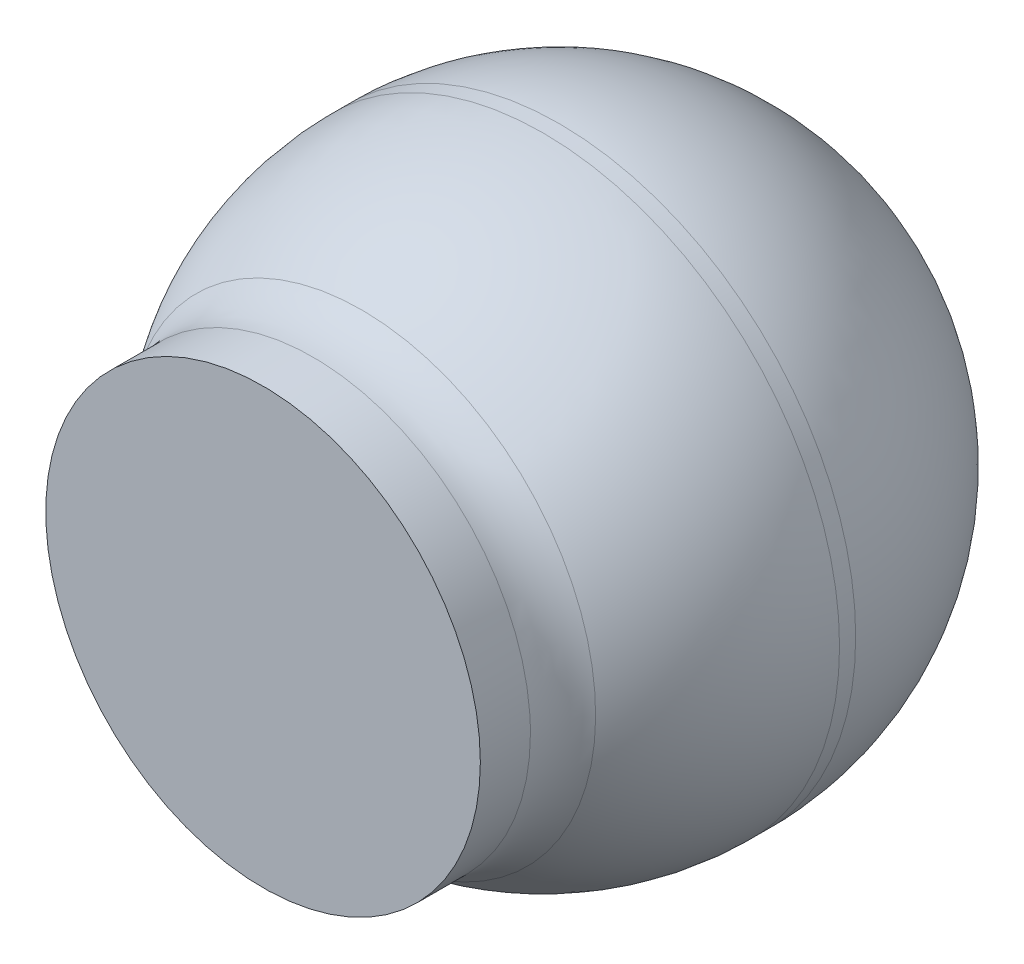
ISO-10303-21;
HEADER;
FILE_DESCRIPTION(('STEP AP214'),'2;1');
FILE_NAME('part.step','',(''),(''),'','','');
FILE_SCHEMA(('AUTOMOTIVE_DESIGN { 1 0 10303 214 1 1 1 1 }'));
ENDSEC;
DATA;
#1=APPLICATION_CONTEXT('core data for automotive mechanical design processes');
#2=APPLICATION_PROTOCOL_DEFINITION('international standard','automotive_design',2000,#1);
#3=PRODUCT_CONTEXT('',#1,'mechanical');
#4=PRODUCT('Part','Part','',(#3));
#5=PRODUCT_RELATED_PRODUCT_CATEGORY('part','',(#4));
#6=PRODUCT_DEFINITION_FORMATION('','',#4);
#7=PRODUCT_DEFINITION_CONTEXT('part definition',#1,'design');
#8=PRODUCT_DEFINITION('design','',#6,#7);
#9=PRODUCT_DEFINITION_SHAPE('','',#8);
#10=(LENGTH_UNIT() NAMED_UNIT(*) SI_UNIT(.MILLI.,.METRE.));
#11=(NAMED_UNIT(*) PLANE_ANGLE_UNIT() SI_UNIT($,.RADIAN.));
#12=(NAMED_UNIT(*) SI_UNIT($,.STERADIAN.) SOLID_ANGLE_UNIT());
#13=UNCERTAINTY_MEASURE_WITH_UNIT(LENGTH_MEASURE(1.E-05),#10,'distance_accuracy_value','');
#14=(GEOMETRIC_REPRESENTATION_CONTEXT(3) GLOBAL_UNCERTAINTY_ASSIGNED_CONTEXT((#13)) GLOBAL_UNIT_ASSIGNED_CONTEXT((#10,
#11,#12)) REPRESENTATION_CONTEXT('',''));
#15=CARTESIAN_POINT('',(0.,0.,0.));
#16=DIRECTION('',(0.,0.,1.));
#17=DIRECTION('',(1.,0.,0.));
#18=AXIS2_PLACEMENT_3D('',#15,#16,#17);
#19=CARTESIAN_POINT('',(-1.832919922269,-11.67134929145,10.006534503384));
#20=DIRECTION('',(0.,0.,-1.));
#21=DIRECTION('',(-1.,0.,0.));
#22=AXIS2_PLACEMENT_3D('',#19,#20,#21);
#23=PLANE('',#22);
#24=CARTESIAN_POINT('',(-1.832919922269,-11.67134929145,10.006534503384));
#25=DIRECTION('',(0.,0.,1.));
#26=DIRECTION('',(1.,0.,0.));
#27=AXIS2_PLACEMENT_3D('',#24,#25,#26);
#28=CIRCLE('',#27,0.275);
#29=CARTESIAN_POINT('',(-1.557919922269,-11.67134929145,10.006534503384));
#30=VERTEX_POINT('',#29);
#31=EDGE_CURVE('E20',#30,#30,#28,.F.);
#32=ORIENTED_EDGE('',*,*,#31,.F.);
#33=EDGE_LOOP('',(#32));
#34=FACE_BOUND('',#33,.T.);
#35=ADVANCED_FACE('F17',(#34),#23,.F.);
#36=CARTESIAN_POINT('',(-1.832919922269,-11.67134929145,9.906534503384));
#37=DIRECTION('',(0.,0.,1.));
#38=DIRECTION('',(1.,0.,0.));
#39=AXIS2_PLACEMENT_3D('',#36,#37,#38);
#40=CYLINDRICAL_SURFACE('',#39,0.275);
#41=CARTESIAN_POINT('',(-1.832919922269,-11.67134929145,9.943180457728));
#42=DIRECTION('',(0.,0.,-1.));
#43=DIRECTION('',(0.996700902337582,0.0811622527992469,0.));
#44=AXIS2_PLACEMENT_3D('',#41,#42,#43);
#45=CIRCLE('',#44,0.275);
#46=CARTESIAN_POINT('',(-1.55882717412616,-11.6490296719302,9.943180457728));
#47=VERTEX_POINT('',#46);
#48=EDGE_CURVE('E66',#47,#47,#45,.F.);
#49=ORIENTED_EDGE('',*,*,#48,.T.);
#50=EDGE_LOOP('',(#49));
#51=FACE_BOUND('',#50,.T.);
#52=ORIENTED_EDGE('',*,*,#31,.T.);
#53=EDGE_LOOP('',(#52));
#54=FACE_BOUND('',#53,.T.);
#55=ADVANCED_FACE('F62',(#51,#54),#40,.T.);
#56=CARTESIAN_POINT('',(-1.832919922269,-11.67134929145,9.943180457728));
#57=DIRECTION('',(0.,0.,-1.));
#58=DIRECTION('',(0.996700902337583,0.0811622527992448,0.));
#59=AXIS2_PLACEMENT_3D('',#56,#57,#58);
#60=TOROIDAL_SURFACE('',#59,0.375,0.1);
#61=ORIENTED_EDGE('',*,*,#48,.F.);
#62=EDGE_LOOP('',(#61));
#63=FACE_BOUND('',#62,.T.);
#64=CARTESIAN_POINT('',(-1.832919922269,-11.67134929145,9.881744931236));
#65=DIRECTION('',(0.,0.,-1.));
#66=DIRECTION('',(-0.996700902338691,-0.0811622527856354,0.));
#67=AXIS2_PLACEMENT_3D('',#64,#65,#66);
#68=CIRCLE('',#67,0.29609704641234);
#69=CARTESIAN_POINT('',(-2.128040115608,-11.69538119478,9.881744931236));
#70=VERTEX_POINT('',#69);
#71=EDGE_CURVE('E39',#70,#70,#68,.T.);
#72=ORIENTED_EDGE('',*,*,#71,.F.);
#73=EDGE_LOOP('',(#72));
#74=FACE_BOUND('',#73,.T.);
#75=ADVANCED_FACE('F57',(#63,#74),#60,.F.);
#76=CARTESIAN_POINT('',(-2.206682760645,-11.70178513625,9.651976062157));
#77=CARTESIAN_POINT('',(-2.206682760645,-11.70178513625,9.701461392103));
#78=CARTESIAN_POINT('',(-2.198526217348,-11.70112094157,9.750947004335));
#79=CARTESIAN_POINT('',(-2.182207085349,-11.69979205995,9.798626332798));
#80=CARTESIAN_POINT('',(-2.158341390838,-11.69784865493,9.842699544317));
#81=CARTESIAN_POINT('',(-2.128040115608,-11.69538119478,9.881744931236));
#82=(BOUNDED_CURVE() B_SPLINE_CURVE(5,(#76,#77,#78,#79,#80,#81),.UNSPECIFIED.,.F.,
.F.) B_SPLINE_CURVE_WITH_KNOTS((6,6),(0.,0.661568582165),
.UNSPECIFIED.) CURVE() GEOMETRIC_REPRESENTATION_ITEM() RATIONAL_B_SPLINE_CURVE((1.,1.,1.,1.,1.,1.)) REPRESENTATION_ITEM(''));
#83=CARTESIAN_POINT('',(-1.832919922269,-11.67134929145,9.651976062157));
#84=DIRECTION('',(0.,0.,-1.));
#85=AXIS1_PLACEMENT('',#83,#84);
#86=SURFACE_OF_REVOLUTION('',#82,#85);
#87=CARTESIAN_POINT('',(-1.832919922269,-11.67134929145,9.651976062157));
#88=DIRECTION('',(0.,0.,1.));
#89=DIRECTION('',(1.,0.,0.));
#90=AXIS2_PLACEMENT_3D('',#87,#88,#89);
#91=CIRCLE('',#90,0.375);
#92=CARTESIAN_POINT('',(-1.457919922269,-11.67134929145,9.651976062157));
#93=VERTEX_POINT('',#92);
#94=EDGE_CURVE('E36',#93,#93,#91,.F.);
#95=ORIENTED_EDGE('',*,*,#94,.F.);
#96=EDGE_LOOP('',(#95));
#97=FACE_BOUND('',#96,.T.);
#98=ORIENTED_EDGE('',*,*,#71,.T.);
#99=EDGE_LOOP('',(#98));
#100=FACE_BOUND('',#99,.T.);
#101=ADVANCED_FACE('F53',(#97,#100),#86,.F.);
#102=CARTESIAN_POINT('',(-1.832919922269,-11.67134929145,9.256534503384));
#103=DIRECTION('',(0.,0.,1.));
#104=DIRECTION('',(1.,0.,0.));
#105=AXIS2_PLACEMENT_3D('',#102,#103,#104);
#106=CYLINDRICAL_SURFACE('',#105,0.375);
#107=CARTESIAN_POINT('',(-1.832919922269,-11.67134929145,9.631534503384));
#108=DIRECTION('',(0.,0.,-1.));
#109=DIRECTION('',(0.0811622527992362,-0.996700902337583,0.));
#110=AXIS2_PLACEMENT_3D('',#107,#108,#109);
#111=CIRCLE('',#110,0.375);
#112=CARTESIAN_POINT('',(-1.80248407746929,-12.0451121298266,9.631534503384));
#113=VERTEX_POINT('',#112);
#114=CARTESIAN_POINT('',(-1.86335576706871,-11.2975864530734,9.631534503384));
#115=VERTEX_POINT('',#114);
#116=EDGE_CURVE('E11',#113,#115,#111,.T.);
#117=ORIENTED_EDGE('',*,*,#116,.F.);
#118=CARTESIAN_POINT('',(-1.832919922269,-11.67134929145,9.631534503384));
#119=DIRECTION('',(3.33436315446763E-12,2.72100352061447E-13,1.));
#120=DIRECTION('',(0.0811622527992359,-0.996700902337583,0.));
#121=AXIS2_PLACEMENT_3D('',#118,#119,#120);
#122=CIRCLE('',#121,0.375);
#123=EDGE_CURVE('E25',#115,#113,#122,.F.);
#124=ORIENTED_EDGE('',*,*,#123,.F.);
#125=EDGE_LOOP('',(#117,#124));
#126=FACE_BOUND('',#125,.T.);
#127=ORIENTED_EDGE('',*,*,#94,.T.);
#128=EDGE_LOOP('',(#127));
#129=FACE_BOUND('',#128,.T.);
#130=ADVANCED_FACE('F34',(#126,#129),#106,.T.);
#131=CARTESIAN_POINT('',(-1.832919922269,-11.67134929145,9.631534503384));
#132=DIRECTION('',(0.0811622527992361,-0.996700902337583,0.));
#133=DIRECTION('',(-0.996700902337583,-0.0811622527992361,0.));
#134=AXIS2_PLACEMENT_3D('',#131,#132,#133);
#135=SPHERICAL_SURFACE('',#134,0.375);
#136=ORIENTED_EDGE('',*,*,#123,.T.);
#137=ORIENTED_EDGE('',*,*,#116,.T.);
#138=EDGE_LOOP('',(#136,#137));
#139=FACE_BOUND('',#138,.T.);
#140=ADVANCED_FACE('F32',(#139),#135,.T.);
#141=CLOSED_SHELL('',(#35,#55,#75,#101,#130,#140));
#142=MANIFOLD_SOLID_BREP('B1',#141);
#143=ADVANCED_BREP_SHAPE_REPRESENTATION('',(#18,#142),#14);
#144=SHAPE_DEFINITION_REPRESENTATION(#9,#143);
ENDSEC;
END-ISO-10303-21;
